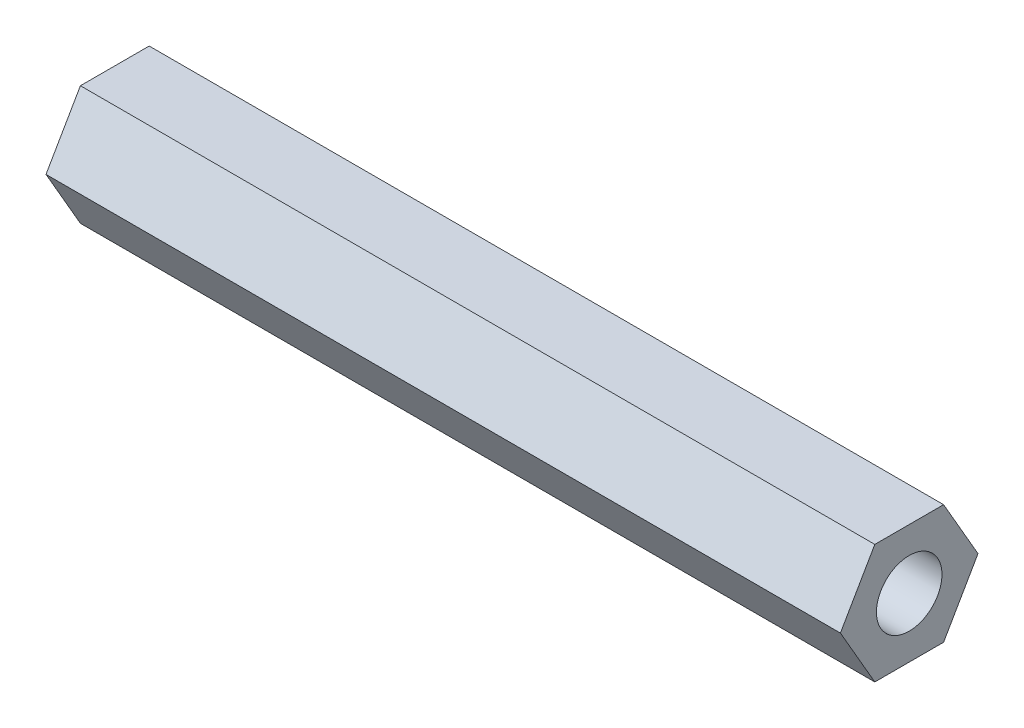
ISO-10303-21;
HEADER;
FILE_DESCRIPTION(('STEP AP214'),'2;1');
FILE_NAME('part.step','',(''),(''),'','','');
FILE_SCHEMA(('AUTOMOTIVE_DESIGN { 1 0 10303 214 1 1 1 1 }'));
ENDSEC;
DATA;
#1=APPLICATION_CONTEXT('core data for automotive mechanical design processes');
#2=APPLICATION_PROTOCOL_DEFINITION('international standard','automotive_design',2000,#1);
#3=PRODUCT_CONTEXT('',#1,'mechanical');
#4=PRODUCT('Part','Part','',(#3));
#5=PRODUCT_RELATED_PRODUCT_CATEGORY('part','',(#4));
#6=PRODUCT_DEFINITION_FORMATION('','',#4);
#7=PRODUCT_DEFINITION_CONTEXT('part definition',#1,'design');
#8=PRODUCT_DEFINITION('design','',#6,#7);
#9=PRODUCT_DEFINITION_SHAPE('','',#8);
#10=(LENGTH_UNIT() NAMED_UNIT(*) SI_UNIT(.MILLI.,.METRE.));
#11=(NAMED_UNIT(*) PLANE_ANGLE_UNIT() SI_UNIT($,.RADIAN.));
#12=(NAMED_UNIT(*) SI_UNIT($,.STERADIAN.) SOLID_ANGLE_UNIT());
#13=UNCERTAINTY_MEASURE_WITH_UNIT(LENGTH_MEASURE(1.E-05),#10,'distance_accuracy_value','');
#14=(GEOMETRIC_REPRESENTATION_CONTEXT(3) GLOBAL_UNCERTAINTY_ASSIGNED_CONTEXT((#13)) GLOBAL_UNIT_ASSIGNED_CONTEXT((#10,
#11,#12)) REPRESENTATION_CONTEXT('',''));
#15=CARTESIAN_POINT('',(0.,0.,0.));
#16=DIRECTION('',(0.,0.,1.));
#17=DIRECTION('',(1.,0.,0.));
#18=AXIS2_PLACEMENT_3D('',#15,#16,#17);
#19=CARTESIAN_POINT('',(40.,-3.,-1.73205080756888));
#20=DIRECTION('',(0.,0.5,0.866025403784439));
#21=DIRECTION('',(0.,-0.866025403784439,0.5));
#22=AXIS2_PLACEMENT_3D('',#19,#20,#21);
#23=PLANE('',#22);
#24=DIRECTION('',(0.,0.866025403784439,-0.5));
#25=VECTOR('',#24,1.);
#26=CARTESIAN_POINT('',(0.,-3.,-1.73205080756888));
#27=LINE('',#26,#25);
#28=CARTESIAN_POINT('',(0.,-3.,-1.73205080756888));
#29=VERTEX_POINT('',#28);
#30=CARTESIAN_POINT('',(0.,0.,-3.46410161513775));
#31=VERTEX_POINT('',#30);
#32=EDGE_CURVE('E127',#29,#31,#27,.T.);
#33=ORIENTED_EDGE('',*,*,#32,.T.);
#34=DIRECTION('',(-1.,0.,0.));
#35=VECTOR('',#34,1.);
#36=CARTESIAN_POINT('',(40.,0.,-3.46410161513775));
#37=LINE('',#36,#35);
#38=CARTESIAN_POINT('',(40.,0.,-3.46410161513775));
#39=VERTEX_POINT('',#38);
#40=EDGE_CURVE('E11',#39,#31,#37,.T.);
#41=ORIENTED_EDGE('',*,*,#40,.F.);
#42=DIRECTION('',(0.,0.866025403784439,-0.5));
#43=VECTOR('',#42,1.);
#44=CARTESIAN_POINT('',(40.,-3.,-1.73205080756888));
#45=LINE('',#44,#43);
#46=CARTESIAN_POINT('',(40.,-3.,-1.73205080756888));
#47=VERTEX_POINT('',#46);
#48=EDGE_CURVE('E138',#47,#39,#45,.T.);
#49=ORIENTED_EDGE('',*,*,#48,.F.);
#50=DIRECTION('',(-1.,0.,0.));
#51=VECTOR('',#50,1.);
#52=CARTESIAN_POINT('',(40.,-3.,-1.73205080756888));
#53=LINE('',#52,#51);
#54=EDGE_CURVE('E123',#47,#29,#53,.T.);
#55=ORIENTED_EDGE('',*,*,#54,.T.);
#56=EDGE_LOOP('',(#33,#41,#49,#55));
#57=FACE_BOUND('',#56,.T.);
#58=ADVANCED_FACE('F43',(#57),#23,.F.);
#59=CARTESIAN_POINT('',(40.,0.,-3.46410161513775));
#60=DIRECTION('',(0.,-0.5,0.866025403784438));
#61=DIRECTION('',(0.,-0.866025403784439,-0.5));
#62=AXIS2_PLACEMENT_3D('',#59,#60,#61);
#63=PLANE('',#62);
#64=DIRECTION('',(0.,0.866025403784438,0.5));
#65=VECTOR('',#64,1.);
#66=CARTESIAN_POINT('',(0.,0.,-3.46410161513775));
#67=LINE('',#66,#65);
#68=CARTESIAN_POINT('',(0.,3.,-1.73205080756888));
#69=VERTEX_POINT('',#68);
#70=EDGE_CURVE('E130',#31,#69,#67,.T.);
#71=ORIENTED_EDGE('',*,*,#70,.T.);
#72=DIRECTION('',(-1.,0.,0.));
#73=VECTOR('',#72,1.);
#74=CARTESIAN_POINT('',(40.,3.,-1.73205080756888));
#75=LINE('',#74,#73);
#76=CARTESIAN_POINT('',(40.,3.,-1.73205080756888));
#77=VERTEX_POINT('',#76);
#78=EDGE_CURVE('E51',#77,#69,#75,.T.);
#79=ORIENTED_EDGE('',*,*,#78,.F.);
#80=DIRECTION('',(0.,0.866025403784438,0.5));
#81=VECTOR('',#80,1.);
#82=CARTESIAN_POINT('',(40.,0.,-3.46410161513775));
#83=LINE('',#82,#81);
#84=EDGE_CURVE('E96',#39,#77,#83,.T.);
#85=ORIENTED_EDGE('',*,*,#84,.F.);
#86=ORIENTED_EDGE('',*,*,#40,.T.);
#87=EDGE_LOOP('',(#71,#79,#85,#86));
#88=FACE_BOUND('',#87,.T.);
#89=ADVANCED_FACE('F163',(#88),#63,.F.);
#90=CARTESIAN_POINT('',(40.,3.,-1.73205080756888));
#91=DIRECTION('',(0.,-1.,0.));
#92=DIRECTION('',(0.,0.,-1.));
#93=AXIS2_PLACEMENT_3D('',#90,#91,#92);
#94=PLANE('',#93);
#95=DIRECTION('',(0.,0.,1.));
#96=VECTOR('',#95,1.);
#97=CARTESIAN_POINT('',(0.,3.,-1.73205080756888));
#98=LINE('',#97,#96);
#99=CARTESIAN_POINT('',(0.,3.,1.73205080756888));
#100=VERTEX_POINT('',#99);
#101=EDGE_CURVE('E133',#69,#100,#98,.T.);
#102=ORIENTED_EDGE('',*,*,#101,.T.);
#103=DIRECTION('',(-1.,0.,0.));
#104=VECTOR('',#103,1.);
#105=CARTESIAN_POINT('',(40.,3.,1.73205080756888));
#106=LINE('',#105,#104);
#107=CARTESIAN_POINT('',(40.,3.,1.73205080756888));
#108=VERTEX_POINT('',#107);
#109=EDGE_CURVE('E118',#108,#100,#106,.T.);
#110=ORIENTED_EDGE('',*,*,#109,.F.);
#111=DIRECTION('',(0.,0.,1.));
#112=VECTOR('',#111,1.);
#113=CARTESIAN_POINT('',(40.,3.,-1.73205080756888));
#114=LINE('',#113,#112);
#115=EDGE_CURVE('E109',#77,#108,#114,.T.);
#116=ORIENTED_EDGE('',*,*,#115,.F.);
#117=ORIENTED_EDGE('',*,*,#78,.T.);
#118=EDGE_LOOP('',(#102,#110,#116,#117));
#119=FACE_BOUND('',#118,.T.);
#120=ADVANCED_FACE('F144',(#119),#94,.F.);
#121=CARTESIAN_POINT('',(40.,3.,1.73205080756888));
#122=DIRECTION('',(0.,-0.5,-0.866025403784439));
#123=DIRECTION('',(0.,0.866025403784439,-0.5));
#124=AXIS2_PLACEMENT_3D('',#121,#122,#123);
#125=PLANE('',#124);
#126=DIRECTION('',(0.,-0.866025403784439,0.5));
#127=VECTOR('',#126,1.);
#128=CARTESIAN_POINT('',(0.,3.,1.73205080756888));
#129=LINE('',#128,#127);
#130=CARTESIAN_POINT('',(0.,0.,3.46410161513775));
#131=VERTEX_POINT('',#130);
#132=EDGE_CURVE('E117',#100,#131,#129,.T.);
#133=ORIENTED_EDGE('',*,*,#132,.T.);
#134=DIRECTION('',(-1.,0.,0.));
#135=VECTOR('',#134,1.);
#136=CARTESIAN_POINT('',(40.,0.,3.46410161513775));
#137=LINE('',#136,#135);
#138=CARTESIAN_POINT('',(40.,0.,3.46410161513775));
#139=VERTEX_POINT('',#138);
#140=EDGE_CURVE('E114',#139,#131,#137,.T.);
#141=ORIENTED_EDGE('',*,*,#140,.F.);
#142=DIRECTION('',(0.,-0.866025403784439,0.5));
#143=VECTOR('',#142,1.);
#144=CARTESIAN_POINT('',(40.,3.,1.73205080756888));
#145=LINE('',#144,#143);
#146=EDGE_CURVE('E103',#108,#139,#145,.T.);
#147=ORIENTED_EDGE('',*,*,#146,.F.);
#148=ORIENTED_EDGE('',*,*,#109,.T.);
#149=EDGE_LOOP('',(#133,#141,#147,#148));
#150=FACE_BOUND('',#149,.T.);
#151=ADVANCED_FACE('F115',(#150),#125,.F.);
#152=CARTESIAN_POINT('',(40.,0.,3.46410161513775));
#153=DIRECTION('',(0.,0.5,-0.866025403784438));
#154=DIRECTION('',(0.,0.866025403784439,0.5));
#155=AXIS2_PLACEMENT_3D('',#152,#153,#154);
#156=PLANE('',#155);
#157=DIRECTION('',(0.,-0.866025403784438,-0.5));
#158=VECTOR('',#157,1.);
#159=CARTESIAN_POINT('',(0.,0.,3.46410161513775));
#160=LINE('',#159,#158);
#161=CARTESIAN_POINT('',(0.,-3.,1.73205080756888));
#162=VERTEX_POINT('',#161);
#163=EDGE_CURVE('E82',#131,#162,#160,.T.);
#164=ORIENTED_EDGE('',*,*,#163,.T.);
#165=DIRECTION('',(-1.,0.,0.));
#166=VECTOR('',#165,1.);
#167=CARTESIAN_POINT('',(40.,-3.,1.73205080756888));
#168=LINE('',#167,#166);
#169=CARTESIAN_POINT('',(40.,-3.,1.73205080756888));
#170=VERTEX_POINT('',#169);
#171=EDGE_CURVE('E119',#170,#162,#168,.T.);
#172=ORIENTED_EDGE('',*,*,#171,.F.);
#173=DIRECTION('',(0.,-0.866025403784438,-0.5));
#174=VECTOR('',#173,1.);
#175=CARTESIAN_POINT('',(40.,0.,3.46410161513775));
#176=LINE('',#175,#174);
#177=EDGE_CURVE('E107',#139,#170,#176,.T.);
#178=ORIENTED_EDGE('',*,*,#177,.F.);
#179=ORIENTED_EDGE('',*,*,#140,.T.);
#180=EDGE_LOOP('',(#164,#172,#178,#179));
#181=FACE_BOUND('',#180,.T.);
#182=ADVANCED_FACE('F121',(#181),#156,.F.);
#183=CARTESIAN_POINT('',(40.,-3.,1.73205080756888));
#184=DIRECTION('',(0.,1.,0.));
#185=DIRECTION('',(0.,0.,1.));
#186=AXIS2_PLACEMENT_3D('',#183,#184,#185);
#187=PLANE('',#186);
#188=DIRECTION('',(0.,0.,-1.));
#189=VECTOR('',#188,1.);
#190=CARTESIAN_POINT('',(0.,-3.,1.73205080756888));
#191=LINE('',#190,#189);
#192=EDGE_CURVE('E88',#162,#29,#191,.T.);
#193=ORIENTED_EDGE('',*,*,#192,.T.);
#194=ORIENTED_EDGE('',*,*,#54,.F.);
#195=DIRECTION('',(0.,0.,-1.));
#196=VECTOR('',#195,1.);
#197=CARTESIAN_POINT('',(40.,-3.,1.73205080756888));
#198=LINE('',#197,#196);
#199=EDGE_CURVE('E59',#170,#47,#198,.T.);
#200=ORIENTED_EDGE('',*,*,#199,.F.);
#201=ORIENTED_EDGE('',*,*,#171,.T.);
#202=EDGE_LOOP('',(#193,#194,#200,#201));
#203=FACE_BOUND('',#202,.T.);
#204=ADVANCED_FACE('F151',(#203),#187,.F.);
#205=CARTESIAN_POINT('',(40.,0.,0.));
#206=DIRECTION('',(1.,0.,0.));
#207=DIRECTION('',(0.,0.,-1.));
#208=AXIS2_PLACEMENT_3D('',#205,#206,#207);
#209=PLANE('',#208);
#210=CARTESIAN_POINT('',(40.,0.,0.));
#211=DIRECTION('',(-1.,0.,0.));
#212=DIRECTION('',(0.,0.,1.));
#213=AXIS2_PLACEMENT_3D('',#210,#211,#212);
#214=CIRCLE('',#213,1.64999999999999);
#215=CARTESIAN_POINT('',(40.,0.,1.64999999999999));
#216=VERTEX_POINT('',#215);
#217=EDGE_CURVE('E131',#216,#216,#214,.T.);
#218=ORIENTED_EDGE('',*,*,#217,.T.);
#219=EDGE_LOOP('',(#218));
#220=FACE_BOUND('',#219,.T.);
#221=ORIENTED_EDGE('',*,*,#48,.T.);
#222=ORIENTED_EDGE('',*,*,#84,.T.);
#223=ORIENTED_EDGE('',*,*,#115,.T.);
#224=ORIENTED_EDGE('',*,*,#146,.T.);
#225=ORIENTED_EDGE('',*,*,#177,.T.);
#226=ORIENTED_EDGE('',*,*,#199,.T.);
#227=EDGE_LOOP('',(#221,#222,#223,#224,#225,#226));
#228=FACE_BOUND('',#227,.T.);
#229=ADVANCED_FACE('F105',(#220,#228),#209,.T.);
#230=CARTESIAN_POINT('',(0.,0.,0.));
#231=DIRECTION('',(1.,0.,0.));
#232=DIRECTION('',(0.,0.,-1.));
#233=AXIS2_PLACEMENT_3D('',#230,#231,#232);
#234=PLANE('',#233);
#235=CARTESIAN_POINT('',(0.,0.,0.));
#236=DIRECTION('',(-1.,0.,0.));
#237=DIRECTION('',(0.,0.,1.));
#238=AXIS2_PLACEMENT_3D('',#235,#236,#237);
#239=CIRCLE('',#238,1.64999999999999);
#240=CARTESIAN_POINT('',(0.,0.,1.64999999999999));
#241=VERTEX_POINT('',#240);
#242=EDGE_CURVE('E239',#241,#241,#239,.T.);
#243=ORIENTED_EDGE('',*,*,#242,.F.);
#244=EDGE_LOOP('',(#243));
#245=FACE_BOUND('',#244,.T.);
#246=ORIENTED_EDGE('',*,*,#32,.F.);
#247=ORIENTED_EDGE('',*,*,#192,.F.);
#248=ORIENTED_EDGE('',*,*,#163,.F.);
#249=ORIENTED_EDGE('',*,*,#132,.F.);
#250=ORIENTED_EDGE('',*,*,#101,.F.);
#251=ORIENTED_EDGE('',*,*,#70,.F.);
#252=EDGE_LOOP('',(#246,#247,#248,#249,#250,#251));
#253=FACE_BOUND('',#252,.T.);
#254=ADVANCED_FACE('F147',(#245,#253),#234,.F.);
#255=CARTESIAN_POINT('',(0.,0.,0.));
#256=DIRECTION('',(-1.,0.,0.));
#257=DIRECTION('',(0.,0.,1.));
#258=AXIS2_PLACEMENT_3D('',#255,#256,#257);
#259=CYLINDRICAL_SURFACE('',#258,1.64999999999999);
#260=ORIENTED_EDGE('',*,*,#217,.F.);
#261=EDGE_LOOP('',(#260));
#262=FACE_BOUND('',#261,.T.);
#263=ORIENTED_EDGE('',*,*,#242,.T.);
#264=EDGE_LOOP('',(#263));
#265=FACE_BOUND('',#264,.T.);
#266=ADVANCED_FACE('F202',(#262,#265),#259,.F.);
#267=CLOSED_SHELL('',(#58,#89,#120,#151,#182,#204,#229,#254,#266));
#268=MANIFOLD_SOLID_BREP('B2',#267);
#269=ADVANCED_BREP_SHAPE_REPRESENTATION('',(#18,#268),#14);
#270=SHAPE_DEFINITION_REPRESENTATION(#9,#269);
ENDSEC;
END-ISO-10303-21;
